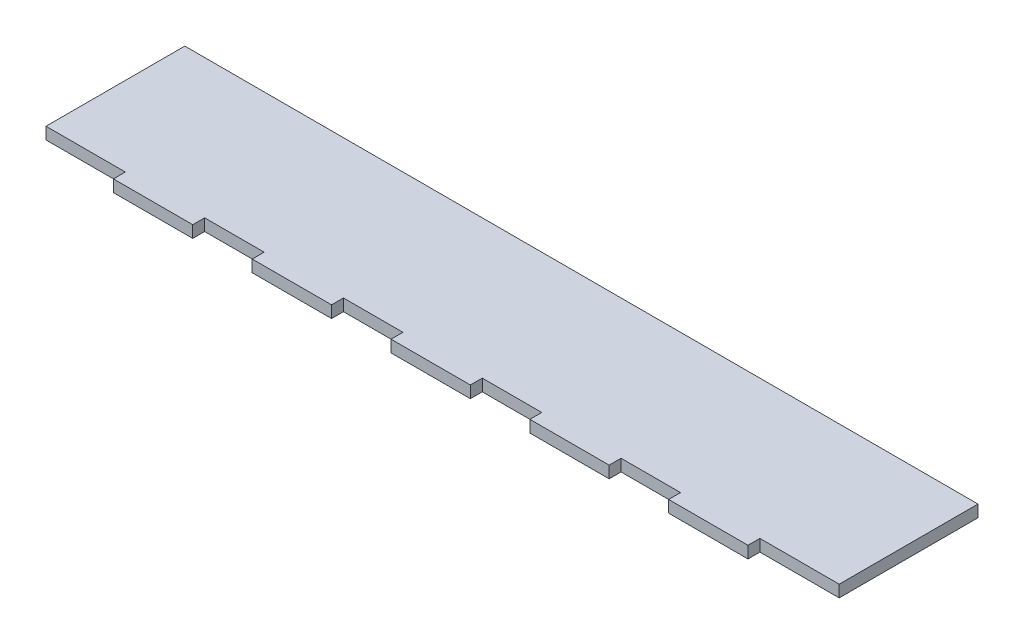
ISO-10303-21;
HEADER;
FILE_DESCRIPTION(('STEP AP214'),'2;1');
FILE_NAME('part.step','',(''),(''),'','','');
FILE_SCHEMA(('AUTOMOTIVE_DESIGN { 1 0 10303 214 1 1 1 1 }'));
ENDSEC;
DATA;
#1=APPLICATION_CONTEXT('core data for automotive mechanical design processes');
#2=APPLICATION_PROTOCOL_DEFINITION('international standard','automotive_design',2000,#1);
#3=PRODUCT_CONTEXT('',#1,'mechanical');
#4=PRODUCT('Part','Part','',(#3));
#5=PRODUCT_RELATED_PRODUCT_CATEGORY('part','',(#4));
#6=PRODUCT_DEFINITION_FORMATION('','',#4);
#7=PRODUCT_DEFINITION_CONTEXT('part definition',#1,'design');
#8=PRODUCT_DEFINITION('design','',#6,#7);
#9=PRODUCT_DEFINITION_SHAPE('','',#8);
#10=(LENGTH_UNIT() NAMED_UNIT(*) SI_UNIT(.MILLI.,.METRE.));
#11=(NAMED_UNIT(*) PLANE_ANGLE_UNIT() SI_UNIT($,.RADIAN.));
#12=(NAMED_UNIT(*) SI_UNIT($,.STERADIAN.) SOLID_ANGLE_UNIT());
#13=UNCERTAINTY_MEASURE_WITH_UNIT(LENGTH_MEASURE(1.E-05),#10,'distance_accuracy_value','');
#14=(GEOMETRIC_REPRESENTATION_CONTEXT(3) GLOBAL_UNCERTAINTY_ASSIGNED_CONTEXT((#13)) GLOBAL_UNIT_ASSIGNED_CONTEXT((#10,
#11,#12)) REPRESENTATION_CONTEXT('',''));
#15=CARTESIAN_POINT('',(0.,0.,0.));
#16=DIRECTION('',(0.,0.,1.));
#17=DIRECTION('',(1.,0.,0.));
#18=AXIS2_PLACEMENT_3D('',#15,#16,#17);
#19=CARTESIAN_POINT('',(0.,3.,0.));
#20=DIRECTION('',(-1.,0.,0.));
#21=DIRECTION('',(0.,0.,1.));
#22=AXIS2_PLACEMENT_3D('',#19,#20,#21);
#23=PLANE('',#22);
#24=DIRECTION('',(0.,0.,-1.));
#25=VECTOR('',#24,1.);
#26=CARTESIAN_POINT('',(0.,0.,0.));
#27=LINE('',#26,#25);
#28=CARTESIAN_POINT('',(0.,0.,0.));
#29=VERTEX_POINT('',#28);
#30=CARTESIAN_POINT('',(0.,0.,-35.));
#31=VERTEX_POINT('',#30);
#32=EDGE_CURVE('E228',#29,#31,#27,.T.);
#33=ORIENTED_EDGE('',*,*,#32,.F.);
#34=DIRECTION('',(0.,-1.,0.));
#35=VECTOR('',#34,1.);
#36=CARTESIAN_POINT('',(0.,3.,0.));
#37=LINE('',#36,#35);
#38=CARTESIAN_POINT('',(0.,3.,0.));
#39=VERTEX_POINT('',#38);
#40=EDGE_CURVE('E11',#39,#29,#37,.T.);
#41=ORIENTED_EDGE('',*,*,#40,.F.);
#42=DIRECTION('',(0.,0.,-1.));
#43=VECTOR('',#42,1.);
#44=CARTESIAN_POINT('',(0.,3.,0.));
#45=LINE('',#44,#43);
#46=CARTESIAN_POINT('',(0.,3.,-35.));
#47=VERTEX_POINT('',#46);
#48=EDGE_CURVE('E285',#39,#47,#45,.T.);
#49=ORIENTED_EDGE('',*,*,#48,.T.);
#50=DIRECTION('',(0.,-1.,0.));
#51=VECTOR('',#50,1.);
#52=CARTESIAN_POINT('',(0.,3.,-35.));
#53=LINE('',#52,#51);
#54=EDGE_CURVE('E36',#47,#31,#53,.T.);
#55=ORIENTED_EDGE('',*,*,#54,.T.);
#56=EDGE_LOOP('',(#33,#41,#49,#55));
#57=FACE_BOUND('',#56,.T.);
#58=ADVANCED_FACE('F33',(#57),#23,.T.);
#59=CARTESIAN_POINT('',(0.,3.,0.));
#60=DIRECTION('',(0.,0.,-1.));
#61=DIRECTION('',(-1.,0.,0.));
#62=AXIS2_PLACEMENT_3D('',#59,#60,#61);
#63=PLANE('',#62);
#64=DIRECTION('',(1.,0.,0.));
#65=VECTOR('',#64,1.);
#66=CARTESIAN_POINT('',(0.,0.,0.));
#67=LINE('',#66,#65);
#68=CARTESIAN_POINT('',(20.,0.,0.));
#69=VERTEX_POINT('',#68);
#70=EDGE_CURVE('E126',#29,#69,#67,.T.);
#71=ORIENTED_EDGE('',*,*,#70,.T.);
#72=DIRECTION('',(0.,-1.,0.));
#73=VECTOR('',#72,1.);
#74=CARTESIAN_POINT('',(20.,3.,0.));
#75=LINE('',#74,#73);
#76=CARTESIAN_POINT('',(20.,3.,0.));
#77=VERTEX_POINT('',#76);
#78=EDGE_CURVE('E42',#77,#69,#75,.T.);
#79=ORIENTED_EDGE('',*,*,#78,.F.);
#80=DIRECTION('',(1.,0.,0.));
#81=VECTOR('',#80,1.);
#82=CARTESIAN_POINT('',(0.,3.,0.));
#83=LINE('',#82,#81);
#84=EDGE_CURVE('E206',#39,#77,#83,.T.);
#85=ORIENTED_EDGE('',*,*,#84,.F.);
#86=ORIENTED_EDGE('',*,*,#40,.T.);
#87=EDGE_LOOP('',(#71,#79,#85,#86));
#88=FACE_BOUND('',#87,.T.);
#89=ADVANCED_FACE('F475',(#88),#63,.F.);
#90=CARTESIAN_POINT('',(20.,3.,0.));
#91=DIRECTION('',(1.,0.,0.));
#92=DIRECTION('',(0.,0.,-1.));
#93=AXIS2_PLACEMENT_3D('',#90,#91,#92);
#94=PLANE('',#93);
#95=DIRECTION('',(0.,0.,1.));
#96=VECTOR('',#95,1.);
#97=CARTESIAN_POINT('',(20.,0.,0.));
#98=LINE('',#97,#96);
#99=CARTESIAN_POINT('',(20.,0.,3.));
#100=VERTEX_POINT('',#99);
#101=EDGE_CURVE('E213',#69,#100,#98,.T.);
#102=ORIENTED_EDGE('',*,*,#101,.T.);
#103=DIRECTION('',(0.,-1.,0.));
#104=VECTOR('',#103,1.);
#105=CARTESIAN_POINT('',(20.,3.,3.));
#106=LINE('',#105,#104);
#107=CARTESIAN_POINT('',(20.,3.,3.));
#108=VERTEX_POINT('',#107);
#109=EDGE_CURVE('E210',#108,#100,#106,.T.);
#110=ORIENTED_EDGE('',*,*,#109,.F.);
#111=DIRECTION('',(0.,0.,1.));
#112=VECTOR('',#111,1.);
#113=CARTESIAN_POINT('',(20.,3.,0.));
#114=LINE('',#113,#112);
#115=EDGE_CURVE('E198',#77,#108,#114,.T.);
#116=ORIENTED_EDGE('',*,*,#115,.F.);
#117=ORIENTED_EDGE('',*,*,#78,.T.);
#118=EDGE_LOOP('',(#102,#110,#116,#117));
#119=FACE_BOUND('',#118,.T.);
#120=ADVANCED_FACE('F211',(#119),#94,.F.);
#121=CARTESIAN_POINT('',(20.,3.,3.));
#122=DIRECTION('',(0.,0.,-1.));
#123=DIRECTION('',(-1.,0.,0.));
#124=AXIS2_PLACEMENT_3D('',#121,#122,#123);
#125=PLANE('',#124);
#126=DIRECTION('',(1.,0.,0.));
#127=VECTOR('',#126,1.);
#128=CARTESIAN_POINT('',(20.,0.,3.));
#129=LINE('',#128,#127);
#130=CARTESIAN_POINT('',(40.,0.,3.));
#131=VERTEX_POINT('',#130);
#132=EDGE_CURVE('E282',#100,#131,#129,.T.);
#133=ORIENTED_EDGE('',*,*,#132,.T.);
#134=DIRECTION('',(0.,-1.,0.));
#135=VECTOR('',#134,1.);
#136=CARTESIAN_POINT('',(40.,3.,3.));
#137=LINE('',#136,#135);
#138=CARTESIAN_POINT('',(40.,3.,3.));
#139=VERTEX_POINT('',#138);
#140=EDGE_CURVE('E217',#139,#131,#137,.T.);
#141=ORIENTED_EDGE('',*,*,#140,.F.);
#142=DIRECTION('',(1.,0.,0.));
#143=VECTOR('',#142,1.);
#144=CARTESIAN_POINT('',(20.,3.,3.));
#145=LINE('',#144,#143);
#146=EDGE_CURVE('E204',#108,#139,#145,.T.);
#147=ORIENTED_EDGE('',*,*,#146,.F.);
#148=ORIENTED_EDGE('',*,*,#109,.T.);
#149=EDGE_LOOP('',(#133,#141,#147,#148));
#150=FACE_BOUND('',#149,.T.);
#151=ADVANCED_FACE('F219',(#150),#125,.F.);
#152=CARTESIAN_POINT('',(40.,3.,0.));
#153=DIRECTION('',(1.,0.,0.));
#154=DIRECTION('',(0.,0.,-1.));
#155=AXIS2_PLACEMENT_3D('',#152,#153,#154);
#156=PLANE('',#155);
#157=DIRECTION('',(0.,0.,1.));
#158=VECTOR('',#157,1.);
#159=CARTESIAN_POINT('',(40.,0.,0.));
#160=LINE('',#159,#158);
#161=CARTESIAN_POINT('',(40.,0.,0.));
#162=VERTEX_POINT('',#161);
#163=EDGE_CURVE('E279',#162,#131,#160,.T.);
#164=ORIENTED_EDGE('',*,*,#163,.F.);
#165=DIRECTION('',(0.,-1.,0.));
#166=VECTOR('',#165,1.);
#167=CARTESIAN_POINT('',(40.,3.,0.));
#168=LINE('',#167,#166);
#169=CARTESIAN_POINT('',(40.,3.,0.));
#170=VERTEX_POINT('',#169);
#171=EDGE_CURVE('E289',#170,#162,#168,.T.);
#172=ORIENTED_EDGE('',*,*,#171,.F.);
#173=DIRECTION('',(0.,0.,1.));
#174=VECTOR('',#173,1.);
#175=CARTESIAN_POINT('',(40.,3.,0.));
#176=LINE('',#175,#174);
#177=EDGE_CURVE('E221',#170,#139,#176,.T.);
#178=ORIENTED_EDGE('',*,*,#177,.T.);
#179=ORIENTED_EDGE('',*,*,#140,.T.);
#180=EDGE_LOOP('',(#164,#172,#178,#179));
#181=FACE_BOUND('',#180,.T.);
#182=ADVANCED_FACE('F343',(#181),#156,.T.);
#183=CARTESIAN_POINT('',(40.,3.,0.));
#184=DIRECTION('',(0.,0.,-1.));
#185=DIRECTION('',(-1.,0.,0.));
#186=AXIS2_PLACEMENT_3D('',#183,#184,#185);
#187=PLANE('',#186);
#188=DIRECTION('',(1.,0.,0.));
#189=VECTOR('',#188,1.);
#190=CARTESIAN_POINT('',(40.,0.,0.));
#191=LINE('',#190,#189);
#192=CARTESIAN_POINT('',(55.,0.,0.));
#193=VERTEX_POINT('',#192);
#194=EDGE_CURVE('E277',#162,#193,#191,.T.);
#195=ORIENTED_EDGE('',*,*,#194,.T.);
#196=DIRECTION('',(0.,-1.,0.));
#197=VECTOR('',#196,1.);
#198=CARTESIAN_POINT('',(55.,3.,0.));
#199=LINE('',#198,#197);
#200=CARTESIAN_POINT('',(55.,3.,0.));
#201=VERTEX_POINT('',#200);
#202=EDGE_CURVE('E291',#201,#193,#199,.T.);
#203=ORIENTED_EDGE('',*,*,#202,.F.);
#204=DIRECTION('',(1.,0.,0.));
#205=VECTOR('',#204,1.);
#206=CARTESIAN_POINT('',(40.,3.,0.));
#207=LINE('',#206,#205);
#208=EDGE_CURVE('E223',#170,#201,#207,.T.);
#209=ORIENTED_EDGE('',*,*,#208,.F.);
#210=ORIENTED_EDGE('',*,*,#171,.T.);
#211=EDGE_LOOP('',(#195,#203,#209,#210));
#212=FACE_BOUND('',#211,.T.);
#213=ADVANCED_FACE('F350',(#212),#187,.F.);
#214=CARTESIAN_POINT('',(55.,3.,0.));
#215=DIRECTION('',(1.,0.,0.));
#216=DIRECTION('',(0.,0.,-1.));
#217=AXIS2_PLACEMENT_3D('',#214,#215,#216);
#218=PLANE('',#217);
#219=DIRECTION('',(0.,0.,1.));
#220=VECTOR('',#219,1.);
#221=CARTESIAN_POINT('',(55.,0.,0.));
#222=LINE('',#221,#220);
#223=CARTESIAN_POINT('',(55.,0.,3.));
#224=VERTEX_POINT('',#223);
#225=EDGE_CURVE('E275',#193,#224,#222,.T.);
#226=ORIENTED_EDGE('',*,*,#225,.T.);
#227=DIRECTION('',(0.,-1.,0.));
#228=VECTOR('',#227,1.);
#229=CARTESIAN_POINT('',(55.,3.,3.));
#230=LINE('',#229,#228);
#231=CARTESIAN_POINT('',(55.,3.,3.));
#232=VERTEX_POINT('',#231);
#233=EDGE_CURVE('E294',#232,#224,#230,.T.);
#234=ORIENTED_EDGE('',*,*,#233,.F.);
#235=DIRECTION('',(0.,0.,1.));
#236=VECTOR('',#235,1.);
#237=CARTESIAN_POINT('',(55.,3.,0.));
#238=LINE('',#237,#236);
#239=EDGE_CURVE('E347',#201,#232,#238,.T.);
#240=ORIENTED_EDGE('',*,*,#239,.F.);
#241=ORIENTED_EDGE('',*,*,#202,.T.);
#242=EDGE_LOOP('',(#226,#234,#240,#241));
#243=FACE_BOUND('',#242,.T.);
#244=ADVANCED_FACE('F352',(#243),#218,.F.);
#245=CARTESIAN_POINT('',(55.,3.,3.));
#246=DIRECTION('',(0.,0.,-1.));
#247=DIRECTION('',(-1.,0.,0.));
#248=AXIS2_PLACEMENT_3D('',#245,#246,#247);
#249=PLANE('',#248);
#250=DIRECTION('',(1.,0.,0.));
#251=VECTOR('',#250,1.);
#252=CARTESIAN_POINT('',(55.,0.,3.));
#253=LINE('',#252,#251);
#254=CARTESIAN_POINT('',(75.,0.,3.));
#255=VERTEX_POINT('',#254);
#256=EDGE_CURVE('E272',#224,#255,#253,.T.);
#257=ORIENTED_EDGE('',*,*,#256,.T.);
#258=DIRECTION('',(0.,-1.,0.));
#259=VECTOR('',#258,1.);
#260=CARTESIAN_POINT('',(75.,3.,3.));
#261=LINE('',#260,#259);
#262=CARTESIAN_POINT('',(75.,3.,3.));
#263=VERTEX_POINT('',#262);
#264=EDGE_CURVE('E297',#263,#255,#261,.T.);
#265=ORIENTED_EDGE('',*,*,#264,.F.);
#266=DIRECTION('',(1.,0.,0.));
#267=VECTOR('',#266,1.);
#268=CARTESIAN_POINT('',(55.,3.,3.));
#269=LINE('',#268,#267);
#270=EDGE_CURVE('E354',#232,#263,#269,.T.);
#271=ORIENTED_EDGE('',*,*,#270,.F.);
#272=ORIENTED_EDGE('',*,*,#233,.T.);
#273=EDGE_LOOP('',(#257,#265,#271,#272));
#274=FACE_BOUND('',#273,.T.);
#275=ADVANCED_FACE('F465',(#274),#249,.F.);
#276=CARTESIAN_POINT('',(75.,3.,0.));
#277=DIRECTION('',(1.,0.,0.));
#278=DIRECTION('',(0.,0.,-1.));
#279=AXIS2_PLACEMENT_3D('',#276,#277,#278);
#280=PLANE('',#279);
#281=DIRECTION('',(0.,0.,1.));
#282=VECTOR('',#281,1.);
#283=CARTESIAN_POINT('',(75.,0.,0.));
#284=LINE('',#283,#282);
#285=CARTESIAN_POINT('',(75.,0.,0.));
#286=VERTEX_POINT('',#285);
#287=EDGE_CURVE('E269',#286,#255,#284,.T.);
#288=ORIENTED_EDGE('',*,*,#287,.F.);
#289=DIRECTION('',(0.,-1.,0.));
#290=VECTOR('',#289,1.);
#291=CARTESIAN_POINT('',(75.,3.,0.));
#292=LINE('',#291,#290);
#293=CARTESIAN_POINT('',(75.,3.,0.));
#294=VERTEX_POINT('',#293);
#295=EDGE_CURVE('E299',#294,#286,#292,.T.);
#296=ORIENTED_EDGE('',*,*,#295,.F.);
#297=DIRECTION('',(0.,0.,1.));
#298=VECTOR('',#297,1.);
#299=CARTESIAN_POINT('',(75.,3.,0.));
#300=LINE('',#299,#298);
#301=EDGE_CURVE('E356',#294,#263,#300,.T.);
#302=ORIENTED_EDGE('',*,*,#301,.T.);
#303=ORIENTED_EDGE('',*,*,#264,.T.);
#304=EDGE_LOOP('',(#288,#296,#302,#303));
#305=FACE_BOUND('',#304,.T.);
#306=ADVANCED_FACE('F461',(#305),#280,.T.);
#307=CARTESIAN_POINT('',(75.,3.,0.));
#308=DIRECTION('',(0.,0.,-1.));
#309=DIRECTION('',(-1.,0.,0.));
#310=AXIS2_PLACEMENT_3D('',#307,#308,#309);
#311=PLANE('',#310);
#312=DIRECTION('',(1.,0.,0.));
#313=VECTOR('',#312,1.);
#314=CARTESIAN_POINT('',(75.,0.,0.));
#315=LINE('',#314,#313);
#316=CARTESIAN_POINT('',(90.,0.,0.));
#317=VERTEX_POINT('',#316);
#318=EDGE_CURVE('E267',#286,#317,#315,.T.);
#319=ORIENTED_EDGE('',*,*,#318,.T.);
#320=DIRECTION('',(0.,-1.,0.));
#321=VECTOR('',#320,1.);
#322=CARTESIAN_POINT('',(90.,3.,0.));
#323=LINE('',#322,#321);
#324=CARTESIAN_POINT('',(90.,3.,0.));
#325=VERTEX_POINT('',#324);
#326=EDGE_CURVE('E301',#325,#317,#323,.T.);
#327=ORIENTED_EDGE('',*,*,#326,.F.);
#328=DIRECTION('',(1.,0.,0.));
#329=VECTOR('',#328,1.);
#330=CARTESIAN_POINT('',(75.,3.,0.));
#331=LINE('',#330,#329);
#332=EDGE_CURVE('E361',#294,#325,#331,.T.);
#333=ORIENTED_EDGE('',*,*,#332,.F.);
#334=ORIENTED_EDGE('',*,*,#295,.T.);
#335=EDGE_LOOP('',(#319,#327,#333,#334));
#336=FACE_BOUND('',#335,.T.);
#337=ADVANCED_FACE('F458',(#336),#311,.F.);
#338=CARTESIAN_POINT('',(90.,3.,0.));
#339=DIRECTION('',(1.,0.,0.));
#340=DIRECTION('',(0.,0.,-1.));
#341=AXIS2_PLACEMENT_3D('',#338,#339,#340);
#342=PLANE('',#341);
#343=DIRECTION('',(0.,0.,1.));
#344=VECTOR('',#343,1.);
#345=CARTESIAN_POINT('',(90.,0.,0.));
#346=LINE('',#345,#344);
#347=CARTESIAN_POINT('',(90.,0.,3.));
#348=VERTEX_POINT('',#347);
#349=EDGE_CURVE('E265',#317,#348,#346,.T.);
#350=ORIENTED_EDGE('',*,*,#349,.T.);
#351=DIRECTION('',(0.,-1.,0.));
#352=VECTOR('',#351,1.);
#353=CARTESIAN_POINT('',(90.,3.,3.));
#354=LINE('',#353,#352);
#355=CARTESIAN_POINT('',(90.,3.,3.));
#356=VERTEX_POINT('',#355);
#357=EDGE_CURVE('E304',#356,#348,#354,.T.);
#358=ORIENTED_EDGE('',*,*,#357,.F.);
#359=DIRECTION('',(0.,0.,1.));
#360=VECTOR('',#359,1.);
#361=CARTESIAN_POINT('',(90.,3.,0.));
#362=LINE('',#361,#360);
#363=EDGE_CURVE('E363',#325,#356,#362,.T.);
#364=ORIENTED_EDGE('',*,*,#363,.F.);
#365=ORIENTED_EDGE('',*,*,#326,.T.);
#366=EDGE_LOOP('',(#350,#358,#364,#365));
#367=FACE_BOUND('',#366,.T.);
#368=ADVANCED_FACE('F453',(#367),#342,.F.);
#369=CARTESIAN_POINT('',(90.,3.,3.));
#370=DIRECTION('',(0.,0.,-1.));
#371=DIRECTION('',(-1.,0.,0.));
#372=AXIS2_PLACEMENT_3D('',#369,#370,#371);
#373=PLANE('',#372);
#374=DIRECTION('',(1.,0.,0.));
#375=VECTOR('',#374,1.);
#376=CARTESIAN_POINT('',(90.,0.,3.));
#377=LINE('',#376,#375);
#378=CARTESIAN_POINT('',(110.,0.,3.));
#379=VERTEX_POINT('',#378);
#380=EDGE_CURVE('E262',#348,#379,#377,.T.);
#381=ORIENTED_EDGE('',*,*,#380,.T.);
#382=DIRECTION('',(0.,-1.,0.));
#383=VECTOR('',#382,1.);
#384=CARTESIAN_POINT('',(110.,3.,3.));
#385=LINE('',#384,#383);
#386=CARTESIAN_POINT('',(110.,3.,3.));
#387=VERTEX_POINT('',#386);
#388=EDGE_CURVE('E307',#387,#379,#385,.T.);
#389=ORIENTED_EDGE('',*,*,#388,.F.);
#390=DIRECTION('',(1.,0.,0.));
#391=VECTOR('',#390,1.);
#392=CARTESIAN_POINT('',(90.,3.,3.));
#393=LINE('',#392,#391);
#394=EDGE_CURVE('E365',#356,#387,#393,.T.);
#395=ORIENTED_EDGE('',*,*,#394,.F.);
#396=ORIENTED_EDGE('',*,*,#357,.T.);
#397=EDGE_LOOP('',(#381,#389,#395,#396));
#398=FACE_BOUND('',#397,.T.);
#399=ADVANCED_FACE('F447',(#398),#373,.F.);
#400=CARTESIAN_POINT('',(110.,3.,0.));
#401=DIRECTION('',(1.,0.,0.));
#402=DIRECTION('',(0.,0.,-1.));
#403=AXIS2_PLACEMENT_3D('',#400,#401,#402);
#404=PLANE('',#403);
#405=DIRECTION('',(0.,0.,1.));
#406=VECTOR('',#405,1.);
#407=CARTESIAN_POINT('',(110.,0.,0.));
#408=LINE('',#407,#406);
#409=CARTESIAN_POINT('',(110.,0.,0.));
#410=VERTEX_POINT('',#409);
#411=EDGE_CURVE('E259',#410,#379,#408,.T.);
#412=ORIENTED_EDGE('',*,*,#411,.F.);
#413=DIRECTION('',(0.,-1.,0.));
#414=VECTOR('',#413,1.);
#415=CARTESIAN_POINT('',(110.,3.,0.));
#416=LINE('',#415,#414);
#417=CARTESIAN_POINT('',(110.,3.,0.));
#418=VERTEX_POINT('',#417);
#419=EDGE_CURVE('E309',#418,#410,#416,.T.);
#420=ORIENTED_EDGE('',*,*,#419,.F.);
#421=DIRECTION('',(0.,0.,1.));
#422=VECTOR('',#421,1.);
#423=CARTESIAN_POINT('',(110.,3.,0.));
#424=LINE('',#423,#422);
#425=EDGE_CURVE('E367',#418,#387,#424,.T.);
#426=ORIENTED_EDGE('',*,*,#425,.T.);
#427=ORIENTED_EDGE('',*,*,#388,.T.);
#428=EDGE_LOOP('',(#412,#420,#426,#427));
#429=FACE_BOUND('',#428,.T.);
#430=ADVANCED_FACE('F443',(#429),#404,.T.);
#431=CARTESIAN_POINT('',(110.,3.,0.));
#432=DIRECTION('',(0.,0.,-1.));
#433=DIRECTION('',(-1.,0.,0.));
#434=AXIS2_PLACEMENT_3D('',#431,#432,#433);
#435=PLANE('',#434);
#436=DIRECTION('',(1.,0.,0.));
#437=VECTOR('',#436,1.);
#438=CARTESIAN_POINT('',(110.,0.,0.));
#439=LINE('',#438,#437);
#440=CARTESIAN_POINT('',(125.,0.,0.));
#441=VERTEX_POINT('',#440);
#442=EDGE_CURVE('E257',#410,#441,#439,.T.);
#443=ORIENTED_EDGE('',*,*,#442,.T.);
#444=DIRECTION('',(0.,-1.,0.));
#445=VECTOR('',#444,1.);
#446=CARTESIAN_POINT('',(125.,3.,0.));
#447=LINE('',#446,#445);
#448=CARTESIAN_POINT('',(125.,3.,0.));
#449=VERTEX_POINT('',#448);
#450=EDGE_CURVE('E311',#449,#441,#447,.T.);
#451=ORIENTED_EDGE('',*,*,#450,.F.);
#452=DIRECTION('',(1.,0.,0.));
#453=VECTOR('',#452,1.);
#454=CARTESIAN_POINT('',(110.,3.,0.));
#455=LINE('',#454,#453);
#456=EDGE_CURVE('E370',#418,#449,#455,.T.);
#457=ORIENTED_EDGE('',*,*,#456,.F.);
#458=ORIENTED_EDGE('',*,*,#419,.T.);
#459=EDGE_LOOP('',(#443,#451,#457,#458));
#460=FACE_BOUND('',#459,.T.);
#461=ADVANCED_FACE('F438',(#460),#435,.F.);
#462=CARTESIAN_POINT('',(125.,3.,0.));
#463=DIRECTION('',(1.,0.,0.));
#464=DIRECTION('',(0.,0.,-1.));
#465=AXIS2_PLACEMENT_3D('',#462,#463,#464);
#466=PLANE('',#465);
#467=DIRECTION('',(0.,0.,1.));
#468=VECTOR('',#467,1.);
#469=CARTESIAN_POINT('',(125.,0.,0.));
#470=LINE('',#469,#468);
#471=CARTESIAN_POINT('',(125.,0.,3.));
#472=VERTEX_POINT('',#471);
#473=EDGE_CURVE('E255',#441,#472,#470,.T.);
#474=ORIENTED_EDGE('',*,*,#473,.T.);
#475=DIRECTION('',(0.,-1.,0.));
#476=VECTOR('',#475,1.);
#477=CARTESIAN_POINT('',(125.,3.,3.));
#478=LINE('',#477,#476);
#479=CARTESIAN_POINT('',(125.,3.,3.));
#480=VERTEX_POINT('',#479);
#481=EDGE_CURVE('E314',#480,#472,#478,.T.);
#482=ORIENTED_EDGE('',*,*,#481,.F.);
#483=DIRECTION('',(0.,0.,1.));
#484=VECTOR('',#483,1.);
#485=CARTESIAN_POINT('',(125.,3.,0.));
#486=LINE('',#485,#484);
#487=EDGE_CURVE('E372',#449,#480,#486,.T.);
#488=ORIENTED_EDGE('',*,*,#487,.F.);
#489=ORIENTED_EDGE('',*,*,#450,.T.);
#490=EDGE_LOOP('',(#474,#482,#488,#489));
#491=FACE_BOUND('',#490,.T.);
#492=ADVANCED_FACE('F434',(#491),#466,.F.);
#493=CARTESIAN_POINT('',(125.,3.,3.));
#494=DIRECTION('',(0.,0.,-1.));
#495=DIRECTION('',(-1.,0.,0.));
#496=AXIS2_PLACEMENT_3D('',#493,#494,#495);
#497=PLANE('',#496);
#498=DIRECTION('',(1.,0.,0.));
#499=VECTOR('',#498,1.);
#500=CARTESIAN_POINT('',(125.,0.,3.));
#501=LINE('',#500,#499);
#502=CARTESIAN_POINT('',(145.,0.,3.));
#503=VERTEX_POINT('',#502);
#504=EDGE_CURVE('E252',#472,#503,#501,.T.);
#505=ORIENTED_EDGE('',*,*,#504,.T.);
#506=DIRECTION('',(0.,-1.,0.));
#507=VECTOR('',#506,1.);
#508=CARTESIAN_POINT('',(145.,3.,3.));
#509=LINE('',#508,#507);
#510=CARTESIAN_POINT('',(145.,3.,3.));
#511=VERTEX_POINT('',#510);
#512=EDGE_CURVE('E317',#511,#503,#509,.T.);
#513=ORIENTED_EDGE('',*,*,#512,.F.);
#514=DIRECTION('',(1.,0.,0.));
#515=VECTOR('',#514,1.);
#516=CARTESIAN_POINT('',(125.,3.,3.));
#517=LINE('',#516,#515);
#518=EDGE_CURVE('E374',#480,#511,#517,.T.);
#519=ORIENTED_EDGE('',*,*,#518,.F.);
#520=ORIENTED_EDGE('',*,*,#481,.T.);
#521=EDGE_LOOP('',(#505,#513,#519,#520));
#522=FACE_BOUND('',#521,.T.);
#523=ADVANCED_FACE('F429',(#522),#497,.F.);
#524=CARTESIAN_POINT('',(145.,3.,0.));
#525=DIRECTION('',(1.,0.,0.));
#526=DIRECTION('',(0.,0.,-1.));
#527=AXIS2_PLACEMENT_3D('',#524,#525,#526);
#528=PLANE('',#527);
#529=DIRECTION('',(0.,0.,1.));
#530=VECTOR('',#529,1.);
#531=CARTESIAN_POINT('',(145.,0.,0.));
#532=LINE('',#531,#530);
#533=CARTESIAN_POINT('',(145.,0.,0.));
#534=VERTEX_POINT('',#533);
#535=EDGE_CURVE('E249',#534,#503,#532,.T.);
#536=ORIENTED_EDGE('',*,*,#535,.F.);
#537=DIRECTION('',(0.,-1.,0.));
#538=VECTOR('',#537,1.);
#539=CARTESIAN_POINT('',(145.,3.,0.));
#540=LINE('',#539,#538);
#541=CARTESIAN_POINT('',(145.,3.,0.));
#542=VERTEX_POINT('',#541);
#543=EDGE_CURVE('E319',#542,#534,#540,.T.);
#544=ORIENTED_EDGE('',*,*,#543,.F.);
#545=DIRECTION('',(0.,0.,1.));
#546=VECTOR('',#545,1.);
#547=CARTESIAN_POINT('',(145.,3.,0.));
#548=LINE('',#547,#546);
#549=EDGE_CURVE('E376',#542,#511,#548,.T.);
#550=ORIENTED_EDGE('',*,*,#549,.T.);
#551=ORIENTED_EDGE('',*,*,#512,.T.);
#552=EDGE_LOOP('',(#536,#544,#550,#551));
#553=FACE_BOUND('',#552,.T.);
#554=ADVANCED_FACE('F423',(#553),#528,.T.);
#555=CARTESIAN_POINT('',(145.,3.,0.));
#556=DIRECTION('',(0.,0.,-1.));
#557=DIRECTION('',(-1.,0.,0.));
#558=AXIS2_PLACEMENT_3D('',#555,#556,#557);
#559=PLANE('',#558);
#560=DIRECTION('',(1.,0.,0.));
#561=VECTOR('',#560,1.);
#562=CARTESIAN_POINT('',(145.,0.,0.));
#563=LINE('',#562,#561);
#564=CARTESIAN_POINT('',(160.,0.,0.));
#565=VERTEX_POINT('',#564);
#566=EDGE_CURVE('E247',#534,#565,#563,.T.);
#567=ORIENTED_EDGE('',*,*,#566,.T.);
#568=DIRECTION('',(0.,-1.,0.));
#569=VECTOR('',#568,1.);
#570=CARTESIAN_POINT('',(160.,3.,0.));
#571=LINE('',#570,#569);
#572=CARTESIAN_POINT('',(160.,3.,0.));
#573=VERTEX_POINT('',#572);
#574=EDGE_CURVE('E321',#573,#565,#571,.T.);
#575=ORIENTED_EDGE('',*,*,#574,.F.);
#576=DIRECTION('',(1.,0.,0.));
#577=VECTOR('',#576,1.);
#578=CARTESIAN_POINT('',(145.,3.,0.));
#579=LINE('',#578,#577);
#580=EDGE_CURVE('E379',#542,#573,#579,.T.);
#581=ORIENTED_EDGE('',*,*,#580,.F.);
#582=ORIENTED_EDGE('',*,*,#543,.T.);
#583=EDGE_LOOP('',(#567,#575,#581,#582));
#584=FACE_BOUND('',#583,.T.);
#585=ADVANCED_FACE('F420',(#584),#559,.F.);
#586=CARTESIAN_POINT('',(160.,3.,0.));
#587=DIRECTION('',(1.,0.,0.));
#588=DIRECTION('',(0.,0.,-1.));
#589=AXIS2_PLACEMENT_3D('',#586,#587,#588);
#590=PLANE('',#589);
#591=DIRECTION('',(0.,0.,1.));
#592=VECTOR('',#591,1.);
#593=CARTESIAN_POINT('',(160.,0.,0.));
#594=LINE('',#593,#592);
#595=CARTESIAN_POINT('',(160.,0.,3.));
#596=VERTEX_POINT('',#595);
#597=EDGE_CURVE('E245',#565,#596,#594,.T.);
#598=ORIENTED_EDGE('',*,*,#597,.T.);
#599=DIRECTION('',(0.,-1.,0.));
#600=VECTOR('',#599,1.);
#601=CARTESIAN_POINT('',(160.,3.,3.));
#602=LINE('',#601,#600);
#603=CARTESIAN_POINT('',(160.,3.,3.));
#604=VERTEX_POINT('',#603);
#605=EDGE_CURVE('E324',#604,#596,#602,.T.);
#606=ORIENTED_EDGE('',*,*,#605,.F.);
#607=DIRECTION('',(0.,0.,1.));
#608=VECTOR('',#607,1.);
#609=CARTESIAN_POINT('',(160.,3.,0.));
#610=LINE('',#609,#608);
#611=EDGE_CURVE('E381',#573,#604,#610,.T.);
#612=ORIENTED_EDGE('',*,*,#611,.F.);
#613=ORIENTED_EDGE('',*,*,#574,.T.);
#614=EDGE_LOOP('',(#598,#606,#612,#613));
#615=FACE_BOUND('',#614,.T.);
#616=ADVANCED_FACE('F415',(#615),#590,.F.);
#617=CARTESIAN_POINT('',(160.,3.,3.));
#618=DIRECTION('',(0.,0.,-1.));
#619=DIRECTION('',(-1.,0.,0.));
#620=AXIS2_PLACEMENT_3D('',#617,#618,#619);
#621=PLANE('',#620);
#622=DIRECTION('',(1.,0.,0.));
#623=VECTOR('',#622,1.);
#624=CARTESIAN_POINT('',(160.,0.,3.));
#625=LINE('',#624,#623);
#626=CARTESIAN_POINT('',(180.,0.,3.));
#627=VERTEX_POINT('',#626);
#628=EDGE_CURVE('E242',#596,#627,#625,.T.);
#629=ORIENTED_EDGE('',*,*,#628,.T.);
#630=DIRECTION('',(0.,-1.,0.));
#631=VECTOR('',#630,1.);
#632=CARTESIAN_POINT('',(180.,3.,3.));
#633=LINE('',#632,#631);
#634=CARTESIAN_POINT('',(180.,3.,3.));
#635=VERTEX_POINT('',#634);
#636=EDGE_CURVE('E327',#635,#627,#633,.T.);
#637=ORIENTED_EDGE('',*,*,#636,.F.);
#638=DIRECTION('',(1.,0.,0.));
#639=VECTOR('',#638,1.);
#640=CARTESIAN_POINT('',(160.,3.,3.));
#641=LINE('',#640,#639);
#642=EDGE_CURVE('E383',#604,#635,#641,.T.);
#643=ORIENTED_EDGE('',*,*,#642,.F.);
#644=ORIENTED_EDGE('',*,*,#605,.T.);
#645=EDGE_LOOP('',(#629,#637,#643,#644));
#646=FACE_BOUND('',#645,.T.);
#647=ADVANCED_FACE('F409',(#646),#621,.F.);
#648=CARTESIAN_POINT('',(180.,3.,0.));
#649=DIRECTION('',(1.,0.,0.));
#650=DIRECTION('',(0.,0.,-1.));
#651=AXIS2_PLACEMENT_3D('',#648,#649,#650);
#652=PLANE('',#651);
#653=DIRECTION('',(0.,0.,1.));
#654=VECTOR('',#653,1.);
#655=CARTESIAN_POINT('',(180.,0.,0.));
#656=LINE('',#655,#654);
#657=CARTESIAN_POINT('',(180.,0.,0.));
#658=VERTEX_POINT('',#657);
#659=EDGE_CURVE('E239',#658,#627,#656,.T.);
#660=ORIENTED_EDGE('',*,*,#659,.F.);
#661=DIRECTION('',(0.,-1.,0.));
#662=VECTOR('',#661,1.);
#663=CARTESIAN_POINT('',(180.,3.,0.));
#664=LINE('',#663,#662);
#665=CARTESIAN_POINT('',(180.,3.,0.));
#666=VERTEX_POINT('',#665);
#667=EDGE_CURVE('E329',#666,#658,#664,.T.);
#668=ORIENTED_EDGE('',*,*,#667,.F.);
#669=DIRECTION('',(0.,0.,1.));
#670=VECTOR('',#669,1.);
#671=CARTESIAN_POINT('',(180.,3.,0.));
#672=LINE('',#671,#670);
#673=EDGE_CURVE('E385',#666,#635,#672,.T.);
#674=ORIENTED_EDGE('',*,*,#673,.T.);
#675=ORIENTED_EDGE('',*,*,#636,.T.);
#676=EDGE_LOOP('',(#660,#668,#674,#675));
#677=FACE_BOUND('',#676,.T.);
#678=ADVANCED_FACE('F405',(#677),#652,.T.);
#679=CARTESIAN_POINT('',(180.,3.,0.));
#680=DIRECTION('',(0.,0.,-1.));
#681=DIRECTION('',(-1.,0.,0.));
#682=AXIS2_PLACEMENT_3D('',#679,#680,#681);
#683=PLANE('',#682);
#684=DIRECTION('',(1.,0.,0.));
#685=VECTOR('',#684,1.);
#686=CARTESIAN_POINT('',(180.,0.,0.));
#687=LINE('',#686,#685);
#688=CARTESIAN_POINT('',(200.,0.,0.));
#689=VERTEX_POINT('',#688);
#690=EDGE_CURVE('E237',#658,#689,#687,.T.);
#691=ORIENTED_EDGE('',*,*,#690,.T.);
#692=DIRECTION('',(0.,-1.,0.));
#693=VECTOR('',#692,1.);
#694=CARTESIAN_POINT('',(200.,3.,0.));
#695=LINE('',#694,#693);
#696=CARTESIAN_POINT('',(200.,3.,0.));
#697=VERTEX_POINT('',#696);
#698=EDGE_CURVE('E331',#697,#689,#695,.T.);
#699=ORIENTED_EDGE('',*,*,#698,.F.);
#700=DIRECTION('',(1.,0.,0.));
#701=VECTOR('',#700,1.);
#702=CARTESIAN_POINT('',(180.,3.,0.));
#703=LINE('',#702,#701);
#704=EDGE_CURVE('E388',#666,#697,#703,.T.);
#705=ORIENTED_EDGE('',*,*,#704,.F.);
#706=ORIENTED_EDGE('',*,*,#667,.T.);
#707=EDGE_LOOP('',(#691,#699,#705,#706));
#708=FACE_BOUND('',#707,.T.);
#709=ADVANCED_FACE('F607',(#708),#683,.F.);
#710=CARTESIAN_POINT('',(200.,3.,0.));
#711=DIRECTION('',(-1.,0.,0.));
#712=DIRECTION('',(0.,0.,1.));
#713=AXIS2_PLACEMENT_3D('',#710,#711,#712);
#714=PLANE('',#713);
#715=DIRECTION('',(0.,0.,-1.));
#716=VECTOR('',#715,1.);
#717=CARTESIAN_POINT('',(200.,0.,0.));
#718=LINE('',#717,#716);
#719=CARTESIAN_POINT('',(200.,0.,-35.));
#720=VERTEX_POINT('',#719);
#721=EDGE_CURVE('E234',#689,#720,#718,.T.);
#722=ORIENTED_EDGE('',*,*,#721,.T.);
#723=DIRECTION('',(0.,-1.,0.));
#724=VECTOR('',#723,1.);
#725=CARTESIAN_POINT('',(200.,3.,-35.));
#726=LINE('',#725,#724);
#727=CARTESIAN_POINT('',(200.,3.,-35.));
#728=VERTEX_POINT('',#727);
#729=EDGE_CURVE('E333',#728,#720,#726,.T.);
#730=ORIENTED_EDGE('',*,*,#729,.F.);
#731=DIRECTION('',(0.,0.,-1.));
#732=VECTOR('',#731,1.);
#733=CARTESIAN_POINT('',(200.,3.,0.));
#734=LINE('',#733,#732);
#735=EDGE_CURVE('E390',#697,#728,#734,.T.);
#736=ORIENTED_EDGE('',*,*,#735,.F.);
#737=ORIENTED_EDGE('',*,*,#698,.T.);
#738=EDGE_LOOP('',(#722,#730,#736,#737));
#739=FACE_BOUND('',#738,.T.);
#740=ADVANCED_FACE('F399',(#739),#714,.F.);
#741=CARTESIAN_POINT('',(0.,3.,-35.));
#742=DIRECTION('',(0.,0.,-1.));
#743=DIRECTION('',(-1.,0.,0.));
#744=AXIS2_PLACEMENT_3D('',#741,#742,#743);
#745=PLANE('',#744);
#746=DIRECTION('',(1.,0.,0.));
#747=VECTOR('',#746,1.);
#748=CARTESIAN_POINT('',(0.,0.,-35.));
#749=LINE('',#748,#747);
#750=EDGE_CURVE('E231',#31,#720,#749,.T.);
#751=ORIENTED_EDGE('',*,*,#750,.F.);
#752=ORIENTED_EDGE('',*,*,#54,.F.);
#753=DIRECTION('',(1.,0.,0.));
#754=VECTOR('',#753,1.);
#755=CARTESIAN_POINT('',(0.,3.,-35.));
#756=LINE('',#755,#754);
#757=EDGE_CURVE('E392',#47,#728,#756,.T.);
#758=ORIENTED_EDGE('',*,*,#757,.T.);
#759=ORIENTED_EDGE('',*,*,#729,.T.);
#760=EDGE_LOOP('',(#751,#752,#758,#759));
#761=FACE_BOUND('',#760,.T.);
#762=ADVANCED_FACE('F335',(#761),#745,.T.);
#763=CARTESIAN_POINT('',(0.,3.,0.));
#764=DIRECTION('',(0.,-1.,0.));
#765=DIRECTION('',(0.,0.,-1.));
#766=AXIS2_PLACEMENT_3D('',#763,#764,#765);
#767=PLANE('',#766);
#768=ORIENTED_EDGE('',*,*,#48,.F.);
#769=ORIENTED_EDGE('',*,*,#84,.T.);
#770=ORIENTED_EDGE('',*,*,#115,.T.);
#771=ORIENTED_EDGE('',*,*,#146,.T.);
#772=ORIENTED_EDGE('',*,*,#177,.F.);
#773=ORIENTED_EDGE('',*,*,#208,.T.);
#774=ORIENTED_EDGE('',*,*,#239,.T.);
#775=ORIENTED_EDGE('',*,*,#270,.T.);
#776=ORIENTED_EDGE('',*,*,#301,.F.);
#777=ORIENTED_EDGE('',*,*,#332,.T.);
#778=ORIENTED_EDGE('',*,*,#363,.T.);
#779=ORIENTED_EDGE('',*,*,#394,.T.);
#780=ORIENTED_EDGE('',*,*,#425,.F.);
#781=ORIENTED_EDGE('',*,*,#456,.T.);
#782=ORIENTED_EDGE('',*,*,#487,.T.);
#783=ORIENTED_EDGE('',*,*,#518,.T.);
#784=ORIENTED_EDGE('',*,*,#549,.F.);
#785=ORIENTED_EDGE('',*,*,#580,.T.);
#786=ORIENTED_EDGE('',*,*,#611,.T.);
#787=ORIENTED_EDGE('',*,*,#642,.T.);
#788=ORIENTED_EDGE('',*,*,#673,.F.);
#789=ORIENTED_EDGE('',*,*,#704,.T.);
#790=ORIENTED_EDGE('',*,*,#735,.T.);
#791=ORIENTED_EDGE('',*,*,#757,.F.);
#792=EDGE_LOOP('',(#768,#769,#770,#771,#772,#773,#774,#775,#776,#777,#778,#779,#780,#781,#782,
#783,#784,#785,#786,#787,#788,#789,#790,#791));
#793=FACE_BOUND('',#792,.T.);
#794=ADVANCED_FACE('F201',(#793),#767,.F.);
#795=CARTESIAN_POINT('',(0.,0.,0.));
#796=DIRECTION('',(0.,-1.,0.));
#797=DIRECTION('',(0.,0.,-1.));
#798=AXIS2_PLACEMENT_3D('',#795,#796,#797);
#799=PLANE('',#798);
#800=ORIENTED_EDGE('',*,*,#32,.T.);
#801=ORIENTED_EDGE('',*,*,#750,.T.);
#802=ORIENTED_EDGE('',*,*,#721,.F.);
#803=ORIENTED_EDGE('',*,*,#690,.F.);
#804=ORIENTED_EDGE('',*,*,#659,.T.);
#805=ORIENTED_EDGE('',*,*,#628,.F.);
#806=ORIENTED_EDGE('',*,*,#597,.F.);
#807=ORIENTED_EDGE('',*,*,#566,.F.);
#808=ORIENTED_EDGE('',*,*,#535,.T.);
#809=ORIENTED_EDGE('',*,*,#504,.F.);
#810=ORIENTED_EDGE('',*,*,#473,.F.);
#811=ORIENTED_EDGE('',*,*,#442,.F.);
#812=ORIENTED_EDGE('',*,*,#411,.T.);
#813=ORIENTED_EDGE('',*,*,#380,.F.);
#814=ORIENTED_EDGE('',*,*,#349,.F.);
#815=ORIENTED_EDGE('',*,*,#318,.F.);
#816=ORIENTED_EDGE('',*,*,#287,.T.);
#817=ORIENTED_EDGE('',*,*,#256,.F.);
#818=ORIENTED_EDGE('',*,*,#225,.F.);
#819=ORIENTED_EDGE('',*,*,#194,.F.);
#820=ORIENTED_EDGE('',*,*,#163,.T.);
#821=ORIENTED_EDGE('',*,*,#132,.F.);
#822=ORIENTED_EDGE('',*,*,#101,.F.);
#823=ORIENTED_EDGE('',*,*,#70,.F.);
#824=EDGE_LOOP('',(#800,#801,#802,#803,#804,#805,#806,#807,#808,#809,#810,#811,#812,#813,#814,
#815,#816,#817,#818,#819,#820,#821,#822,#823));
#825=FACE_BOUND('',#824,.T.);
#826=ADVANCED_FACE('F338',(#825),#799,.T.);
#827=CLOSED_SHELL('',(#58,#89,#120,#151,#182,#213,#244,#275,#306,#337,#368,#399,#430,#461,#492,
#523,#554,#585,#616,#647,#678,#709,#740,#762,#794,#826));
#828=MANIFOLD_SOLID_BREP('B2',#827);
#829=ADVANCED_BREP_SHAPE_REPRESENTATION('',(#18,#828),#14);
#830=SHAPE_DEFINITION_REPRESENTATION(#9,#829);
ENDSEC;
END-ISO-10303-21;
